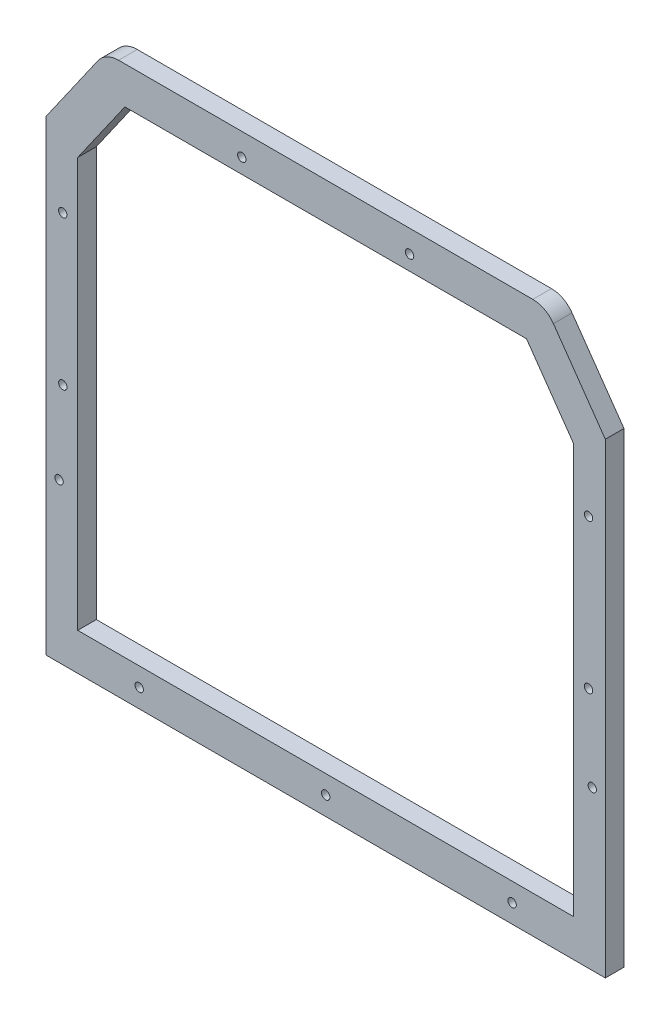
ISO-10303-21;
HEADER;
FILE_DESCRIPTION(('STEP AP214'),'2;1');
FILE_NAME('part.step','',(''),(''),'','','');
FILE_SCHEMA(('AUTOMOTIVE_DESIGN { 1 0 10303 214 1 1 1 1 }'));
ENDSEC;
DATA;
#1=APPLICATION_CONTEXT('core data for automotive mechanical design processes');
#2=APPLICATION_PROTOCOL_DEFINITION('international standard','automotive_design',2000,#1);
#3=PRODUCT_CONTEXT('',#1,'mechanical');
#4=PRODUCT('Part','Part','',(#3));
#5=PRODUCT_RELATED_PRODUCT_CATEGORY('part','',(#4));
#6=PRODUCT_DEFINITION_FORMATION('','',#4);
#7=PRODUCT_DEFINITION_CONTEXT('part definition',#1,'design');
#8=PRODUCT_DEFINITION('design','',#6,#7);
#9=PRODUCT_DEFINITION_SHAPE('','',#8);
#10=(LENGTH_UNIT() NAMED_UNIT(*) SI_UNIT(.MILLI.,.METRE.));
#11=(NAMED_UNIT(*) PLANE_ANGLE_UNIT() SI_UNIT($,.RADIAN.));
#12=(NAMED_UNIT(*) SI_UNIT($,.STERADIAN.) SOLID_ANGLE_UNIT());
#13=UNCERTAINTY_MEASURE_WITH_UNIT(LENGTH_MEASURE(1.E-05),#10,'distance_accuracy_value','');
#14=(GEOMETRIC_REPRESENTATION_CONTEXT(3) GLOBAL_UNCERTAINTY_ASSIGNED_CONTEXT((#13)) GLOBAL_UNIT_ASSIGNED_CONTEXT((#10,
#11,#12)) REPRESENTATION_CONTEXT('',''));
#15=CARTESIAN_POINT('',(0.,0.,0.));
#16=DIRECTION('',(0.,0.,1.));
#17=DIRECTION('',(1.,0.,0.));
#18=AXIS2_PLACEMENT_3D('',#15,#16,#17);
#19=CARTESIAN_POINT('',(292.5,121.743466350134,10.));
#20=DIRECTION('',(0.,0.,1.));
#21=DIRECTION('',(1.,0.,0.));
#22=AXIS2_PLACEMENT_3D('',#19,#20,#21);
#23=PLANE('',#22);
#24=CARTESIAN_POINT('',(10.,-35.,10.));
#25=DIRECTION('',(0.,0.,1.));
#26=DIRECTION('',(1.,0.,0.));
#27=AXIS2_PLACEMENT_3D('',#24,#25,#26);
#28=CIRCLE('',#27,2.25);
#29=CARTESIAN_POINT('',(12.25,-35.,10.));
#30=VERTEX_POINT('',#29);
#31=EDGE_CURVE('E254',#30,#30,#28,.T.);
#32=ORIENTED_EDGE('',*,*,#31,.F.);
#33=EDGE_LOOP('',(#32));
#34=FACE_BOUND('',#33,.T.);
#35=CARTESIAN_POINT('',(253.,-110.,10.));
#36=DIRECTION('',(0.,0.,1.));
#37=DIRECTION('',(1.,0.,0.));
#38=AXIS2_PLACEMENT_3D('',#35,#36,#37);
#39=CIRCLE('',#38,2.25000000000001);
#40=CARTESIAN_POINT('',(255.25,-110.,10.));
#41=VERTEX_POINT('',#40);
#42=EDGE_CURVE('E157',#41,#41,#39,.T.);
#43=ORIENTED_EDGE('',*,*,#42,.F.);
#44=EDGE_LOOP('',(#43));
#45=FACE_BOUND('',#44,.T.);
#46=CARTESIAN_POINT('',(153.,-110.,10.));
#47=DIRECTION('',(0.,0.,1.));
#48=DIRECTION('',(1.,0.,0.));
#49=AXIS2_PLACEMENT_3D('',#46,#47,#48);
#50=CIRCLE('',#49,2.25000000000001);
#51=CARTESIAN_POINT('',(155.25,-110.,10.));
#52=VERTEX_POINT('',#51);
#53=EDGE_CURVE('E264',#52,#52,#50,.T.);
#54=ORIENTED_EDGE('',*,*,#53,.F.);
#55=EDGE_LOOP('',(#54));
#56=FACE_BOUND('',#55,.T.);
#57=CARTESIAN_POINT('',(53.,-110.,10.));
#58=DIRECTION('',(0.,0.,1.));
#59=DIRECTION('',(1.,0.,0.));
#60=AXIS2_PLACEMENT_3D('',#57,#58,#59);
#61=CIRCLE('',#60,2.25);
#62=CARTESIAN_POINT('',(55.25,-110.,10.));
#63=VERTEX_POINT('',#62);
#64=EDGE_CURVE('E263',#63,#63,#61,.T.);
#65=ORIENTED_EDGE('',*,*,#64,.F.);
#66=EDGE_LOOP('',(#65));
#67=FACE_BOUND('',#66,.T.);
#68=CARTESIAN_POINT('',(296.,-35.,10.));
#69=DIRECTION('',(0.,0.,1.));
#70=DIRECTION('',(1.,0.,0.));
#71=AXIS2_PLACEMENT_3D('',#68,#69,#70);
#72=CIRCLE('',#71,2.24999999999995);
#73=CARTESIAN_POINT('',(298.25,-35.,10.));
#74=VERTEX_POINT('',#73);
#75=EDGE_CURVE('E278',#74,#74,#72,.T.);
#76=ORIENTED_EDGE('',*,*,#75,.F.);
#77=EDGE_LOOP('',(#76));
#78=FACE_BOUND('',#77,.T.);
#79=CARTESIAN_POINT('',(198.,163.806661735131,10.));
#80=DIRECTION('',(0.,0.,1.));
#81=DIRECTION('',(1.,0.,0.));
#82=AXIS2_PLACEMENT_3D('',#79,#80,#81);
#83=CIRCLE('',#82,2.25000000000001);
#84=CARTESIAN_POINT('',(200.25,163.806661735131,10.));
#85=VERTEX_POINT('',#84);
#86=EDGE_CURVE('E302',#85,#85,#83,.T.);
#87=ORIENTED_EDGE('',*,*,#86,.F.);
#88=EDGE_LOOP('',(#87));
#89=FACE_BOUND('',#88,.T.);
#90=CARTESIAN_POINT('',(12.,10.,10.));
#91=DIRECTION('',(0.,0.,1.));
#92=DIRECTION('',(1.,0.,0.));
#93=AXIS2_PLACEMENT_3D('',#90,#91,#92);
#94=CIRCLE('',#93,2.25);
#95=CARTESIAN_POINT('',(14.25,10.,10.));
#96=VERTEX_POINT('',#95);
#97=EDGE_CURVE('E310',#96,#96,#94,.T.);
#98=ORIENTED_EDGE('',*,*,#97,.F.);
#99=EDGE_LOOP('',(#98));
#100=FACE_BOUND('',#99,.T.);
#101=CARTESIAN_POINT('',(294.,10.,10.));
#102=DIRECTION('',(0.,0.,1.));
#103=DIRECTION('',(1.,0.,0.));
#104=AXIS2_PLACEMENT_3D('',#101,#102,#103);
#105=CIRCLE('',#104,2.24999999999995);
#106=CARTESIAN_POINT('',(296.25,10.,10.));
#107=VERTEX_POINT('',#106);
#108=EDGE_CURVE('E318',#107,#107,#105,.T.);
#109=ORIENTED_EDGE('',*,*,#108,.F.);
#110=EDGE_LOOP('',(#109));
#111=FACE_BOUND('',#110,.T.);
#112=CARTESIAN_POINT('',(294.,90.,10.));
#113=DIRECTION('',(0.,0.,1.));
#114=DIRECTION('',(-1.,0.,0.));
#115=AXIS2_PLACEMENT_3D('',#112,#113,#114);
#116=CIRCLE('',#115,2.24999999999995);
#117=CARTESIAN_POINT('',(291.75,90.,10.));
#118=VERTEX_POINT('',#117);
#119=EDGE_CURVE('E293',#118,#118,#116,.T.);
#120=ORIENTED_EDGE('',*,*,#119,.F.);
#121=EDGE_LOOP('',(#120));
#122=FACE_BOUND('',#121,.T.);
#123=CARTESIAN_POINT('',(12.,90.,10.));
#124=DIRECTION('',(0.,0.,1.));
#125=DIRECTION('',(-1.,0.,0.));
#126=AXIS2_PLACEMENT_3D('',#123,#124,#125);
#127=CIRCLE('',#126,2.25);
#128=CARTESIAN_POINT('',(9.75000000000001,90.,10.));
#129=VERTEX_POINT('',#128);
#130=EDGE_CURVE('E253',#129,#129,#127,.T.);
#131=ORIENTED_EDGE('',*,*,#130,.F.);
#132=EDGE_LOOP('',(#131));
#133=FACE_BOUND('',#132,.T.);
#134=CARTESIAN_POINT('',(108.,163.806661735131,10.));
#135=DIRECTION('',(0.,0.,1.));
#136=DIRECTION('',(1.,0.,0.));
#137=AXIS2_PLACEMENT_3D('',#134,#135,#136);
#138=CIRCLE('',#137,2.25);
#139=CARTESIAN_POINT('',(110.25,163.806661735131,10.));
#140=VERTEX_POINT('',#139);
#141=EDGE_CURVE('E301',#140,#140,#138,.T.);
#142=ORIENTED_EDGE('',*,*,#141,.F.);
#143=EDGE_LOOP('',(#142));
#144=FACE_BOUND('',#143,.T.);
#145=DIRECTION('',(0.,1.,0.));
#146=VECTOR('',#145,1.);
#147=CARTESIAN_POINT('',(286.,-100.,10.));
#148=LINE('',#147,#146);
#149=CARTESIAN_POINT('',(286.,-100.,10.));
#150=VERTEX_POINT('',#149);
#151=CARTESIAN_POINT('',(286.,119.69402422242,10.));
#152=VERTEX_POINT('',#151);
#153=EDGE_CURVE('E344',#150,#152,#148,.T.);
#154=ORIENTED_EDGE('',*,*,#153,.F.);
#155=DIRECTION('',(1.,0.,0.));
#156=VECTOR('',#155,1.);
#157=CARTESIAN_POINT('',(20.,-100.,10.));
#158=LINE('',#157,#156);
#159=CARTESIAN_POINT('',(20.,-100.,10.));
#160=VERTEX_POINT('',#159);
#161=EDGE_CURVE('E340',#160,#150,#158,.T.);
#162=ORIENTED_EDGE('',*,*,#161,.F.);
#163=DIRECTION('',(0.,-1.,0.));
#164=VECTOR('',#163,1.);
#165=CARTESIAN_POINT('',(20.,0.,10.));
#166=LINE('',#165,#164);
#167=CARTESIAN_POINT('',(20.,119.69402422242,10.));
#168=VERTEX_POINT('',#167);
#169=EDGE_CURVE('E337',#168,#160,#166,.T.);
#170=ORIENTED_EDGE('',*,*,#169,.F.);
#171=DIRECTION('',(-0.573576436351046,-0.819152044288992,0.));
#172=VECTOR('',#171,1.);
#173=CARTESIAN_POINT('',(20.,119.69402422242,10.));
#174=LINE('',#173,#172);
#175=CARTESIAN_POINT('',(45.2863410110351,155.806661735131,10.));
#176=VERTEX_POINT('',#175);
#177=EDGE_CURVE('E353',#176,#168,#174,.T.);
#178=ORIENTED_EDGE('',*,*,#177,.F.);
#179=DIRECTION('',(-1.,0.,0.));
#180=VECTOR('',#179,1.);
#181=CARTESIAN_POINT('',(45.2863410110351,155.806661735131,10.));
#182=LINE('',#181,#180);
#183=CARTESIAN_POINT('',(260.713658988965,155.806661735131,10.));
#184=VERTEX_POINT('',#183);
#185=EDGE_CURVE('E350',#184,#176,#182,.T.);
#186=ORIENTED_EDGE('',*,*,#185,.F.);
#187=DIRECTION('',(-0.573576436351044,0.819152044288994,0.));
#188=VECTOR('',#187,1.);
#189=CARTESIAN_POINT('',(260.713658988965,155.806661735131,10.));
#190=LINE('',#189,#188);
#191=EDGE_CURVE('E347',#152,#184,#190,.T.);
#192=ORIENTED_EDGE('',*,*,#191,.F.);
#193=EDGE_LOOP('',(#154,#162,#170,#178,#186,#192));
#194=FACE_BOUND('',#193,.T.);
#195=DIRECTION('',(-0.573576436351046,-0.819152044288992,0.));
#196=VECTOR('',#195,1.);
#197=CARTESIAN_POINT('',(30.8441025845472,170.049943625871,10.));
#198=LINE('',#197,#196);
#199=CARTESIAN_POINT('',(30.8441025845472,170.049943625871,10.));
#200=VERTEX_POINT('',#199);
#201=CARTESIAN_POINT('',(3.00000000000001,130.284444020226,10.));
#202=VERTEX_POINT('',#201);
#203=EDGE_CURVE('E153',#200,#202,#198,.T.);
#204=ORIENTED_EDGE('',*,*,#203,.T.);
#205=DIRECTION('',(0.,-1.,0.));
#206=VECTOR('',#205,1.);
#207=CARTESIAN_POINT('',(3.,206.355320804604,10.));
#208=LINE('',#207,#206);
#209=CARTESIAN_POINT('',(3.00000000000004,-120.,10.));
#210=VERTEX_POINT('',#209);
#211=EDGE_CURVE('E138',#202,#210,#208,.T.);
#212=ORIENTED_EDGE('',*,*,#211,.T.);
#213=DIRECTION('',(1.,0.,0.));
#214=VECTOR('',#213,1.);
#215=CARTESIAN_POINT('',(0.,-120.,10.));
#216=LINE('',#215,#214);
#217=CARTESIAN_POINT('',(303.,-120.,10.));
#218=VERTEX_POINT('',#217);
#219=EDGE_CURVE('E164',#210,#218,#216,.T.);
#220=ORIENTED_EDGE('',*,*,#219,.T.);
#221=DIRECTION('',(0.,1.,0.));
#222=VECTOR('',#221,1.);
#223=CARTESIAN_POINT('',(303.,206.355320804604,10.));
#224=LINE('',#223,#222);
#225=CARTESIAN_POINT('',(303.,130.284444020227,10.));
#226=VERTEX_POINT('',#225);
#227=EDGE_CURVE('E55',#218,#226,#224,.T.);
#228=ORIENTED_EDGE('',*,*,#227,.T.);
#229=DIRECTION('',(-0.573576436351046,0.819152044288992,0.));
#230=VECTOR('',#229,1.);
#231=CARTESIAN_POINT('',(303.558552597902,129.486748240873,10.));
#232=LINE('',#231,#230);
#233=CARTESIAN_POINT('',(275.155897415453,170.04994362587,10.));
#234=VERTEX_POINT('',#233);
#235=EDGE_CURVE('E193',#226,#234,#232,.T.);
#236=ORIENTED_EDGE('',*,*,#235,.T.);
#237=CARTESIAN_POINT('',(264.097344817551,162.306661735131,10.));
#238=DIRECTION('',(0.,0.,1.));
#239=DIRECTION('',(1.,0.,0.));
#240=AXIS2_PLACEMENT_3D('',#237,#238,#239);
#241=CIRCLE('',#240,13.5000000000001);
#242=CARTESIAN_POINT('',(264.097344817551,175.806661735131,10.));
#243=VERTEX_POINT('',#242);
#244=EDGE_CURVE('E228',#234,#243,#241,.T.);
#245=ORIENTED_EDGE('',*,*,#244,.T.);
#246=DIRECTION('',(-1.,0.,0.));
#247=VECTOR('',#246,1.);
#248=CARTESIAN_POINT('',(264.097344817551,175.806661735131,10.));
#249=LINE('',#248,#247);
#250=CARTESIAN_POINT('',(41.9026551824486,175.806661735131,10.));
#251=VERTEX_POINT('',#250);
#252=EDGE_CURVE('E170',#243,#251,#249,.T.);
#253=ORIENTED_EDGE('',*,*,#252,.T.);
#254=CARTESIAN_POINT('',(41.9026551824486,162.306661735131,10.));
#255=DIRECTION('',(0.,0.,1.));
#256=DIRECTION('',(1.,0.,0.));
#257=AXIS2_PLACEMENT_3D('',#254,#255,#256);
#258=CIRCLE('',#257,13.5);
#259=EDGE_CURVE('E161',#251,#200,#258,.T.);
#260=ORIENTED_EDGE('',*,*,#259,.T.);
#261=EDGE_LOOP('',(#204,#212,#220,#228,#236,#245,#253,#260));
#262=FACE_BOUND('',#261,.T.);
#263=ADVANCED_FACE('F39',(#34,#45,#56,#67,#78,#89,#100,#111,#122,#133,#144,#194,#262),#23,.T.);
#264=CARTESIAN_POINT('',(292.5,121.743466350134,0.));
#265=DIRECTION('',(0.,0.,1.));
#266=DIRECTION('',(1.,0.,0.));
#267=AXIS2_PLACEMENT_3D('',#264,#265,#266);
#268=PLANE('',#267);
#269=CARTESIAN_POINT('',(10.,-35.,0.));
#270=DIRECTION('',(0.,0.,1.));
#271=DIRECTION('',(1.,0.,0.));
#272=AXIS2_PLACEMENT_3D('',#269,#270,#271);
#273=CIRCLE('',#272,2.25);
#274=CARTESIAN_POINT('',(12.25,-35.,0.));
#275=VERTEX_POINT('',#274);
#276=EDGE_CURVE('E249',#275,#275,#273,.T.);
#277=ORIENTED_EDGE('',*,*,#276,.T.);
#278=EDGE_LOOP('',(#277));
#279=FACE_BOUND('',#278,.T.);
#280=CARTESIAN_POINT('',(253.,-110.,0.));
#281=DIRECTION('',(0.,0.,1.));
#282=DIRECTION('',(1.,0.,0.));
#283=AXIS2_PLACEMENT_3D('',#280,#281,#282);
#284=CIRCLE('',#283,2.25000000000001);
#285=CARTESIAN_POINT('',(255.25,-110.,0.));
#286=VERTEX_POINT('',#285);
#287=EDGE_CURVE('E268',#286,#286,#284,.T.);
#288=ORIENTED_EDGE('',*,*,#287,.T.);
#289=EDGE_LOOP('',(#288));
#290=FACE_BOUND('',#289,.T.);
#291=CARTESIAN_POINT('',(153.,-110.,0.));
#292=DIRECTION('',(0.,0.,1.));
#293=DIRECTION('',(1.,0.,0.));
#294=AXIS2_PLACEMENT_3D('',#291,#292,#293);
#295=CIRCLE('',#294,2.25000000000001);
#296=CARTESIAN_POINT('',(155.25,-110.,0.));
#297=VERTEX_POINT('',#296);
#298=EDGE_CURVE('E259',#297,#297,#295,.T.);
#299=ORIENTED_EDGE('',*,*,#298,.T.);
#300=EDGE_LOOP('',(#299));
#301=FACE_BOUND('',#300,.T.);
#302=CARTESIAN_POINT('',(53.,-110.,0.));
#303=DIRECTION('',(0.,0.,1.));
#304=DIRECTION('',(1.,0.,0.));
#305=AXIS2_PLACEMENT_3D('',#302,#303,#304);
#306=CIRCLE('',#305,2.25);
#307=CARTESIAN_POINT('',(55.25,-110.,0.));
#308=VERTEX_POINT('',#307);
#309=EDGE_CURVE('E282',#308,#308,#306,.T.);
#310=ORIENTED_EDGE('',*,*,#309,.T.);
#311=EDGE_LOOP('',(#310));
#312=FACE_BOUND('',#311,.T.);
#313=CARTESIAN_POINT('',(296.,-35.,0.));
#314=DIRECTION('',(0.,0.,1.));
#315=DIRECTION('',(1.,0.,0.));
#316=AXIS2_PLACEMENT_3D('',#313,#314,#315);
#317=CIRCLE('',#316,2.24999999999995);
#318=CARTESIAN_POINT('',(298.25,-35.,0.));
#319=VERTEX_POINT('',#318);
#320=EDGE_CURVE('E258',#319,#319,#317,.T.);
#321=ORIENTED_EDGE('',*,*,#320,.T.);
#322=EDGE_LOOP('',(#321));
#323=FACE_BOUND('',#322,.T.);
#324=CARTESIAN_POINT('',(198.,163.806661735131,0.));
#325=DIRECTION('',(0.,0.,1.));
#326=DIRECTION('',(1.,0.,0.));
#327=AXIS2_PLACEMENT_3D('',#324,#325,#326);
#328=CIRCLE('',#327,2.25000000000001);
#329=CARTESIAN_POINT('',(200.25,163.806661735131,0.));
#330=VERTEX_POINT('',#329);
#331=EDGE_CURVE('E297',#330,#330,#328,.T.);
#332=ORIENTED_EDGE('',*,*,#331,.T.);
#333=EDGE_LOOP('',(#332));
#334=FACE_BOUND('',#333,.T.);
#335=CARTESIAN_POINT('',(12.,10.,0.));
#336=DIRECTION('',(0.,0.,1.));
#337=DIRECTION('',(1.,0.,0.));
#338=AXIS2_PLACEMENT_3D('',#335,#336,#337);
#339=CIRCLE('',#338,2.25);
#340=CARTESIAN_POINT('',(14.25,10.,0.));
#341=VERTEX_POINT('',#340);
#342=EDGE_CURVE('E306',#341,#341,#339,.T.);
#343=ORIENTED_EDGE('',*,*,#342,.T.);
#344=EDGE_LOOP('',(#343));
#345=FACE_BOUND('',#344,.T.);
#346=CARTESIAN_POINT('',(294.,10.,0.));
#347=DIRECTION('',(0.,0.,1.));
#348=DIRECTION('',(1.,0.,0.));
#349=AXIS2_PLACEMENT_3D('',#346,#347,#348);
#350=CIRCLE('',#349,2.24999999999995);
#351=CARTESIAN_POINT('',(296.25,10.,0.));
#352=VERTEX_POINT('',#351);
#353=EDGE_CURVE('E314',#352,#352,#350,.T.);
#354=ORIENTED_EDGE('',*,*,#353,.T.);
#355=EDGE_LOOP('',(#354));
#356=FACE_BOUND('',#355,.T.);
#357=CARTESIAN_POINT('',(294.,90.,0.));
#358=DIRECTION('',(0.,0.,1.));
#359=DIRECTION('',(-1.,0.,0.));
#360=AXIS2_PLACEMENT_3D('',#357,#358,#359);
#361=CIRCLE('',#360,2.24999999999995);
#362=CARTESIAN_POINT('',(291.75,90.,0.));
#363=VERTEX_POINT('',#362);
#364=EDGE_CURVE('E322',#363,#363,#361,.T.);
#365=ORIENTED_EDGE('',*,*,#364,.T.);
#366=EDGE_LOOP('',(#365));
#367=FACE_BOUND('',#366,.T.);
#368=CARTESIAN_POINT('',(12.,90.,0.));
#369=DIRECTION('',(0.,0.,1.));
#370=DIRECTION('',(-1.,0.,0.));
#371=AXIS2_PLACEMENT_3D('',#368,#369,#370);
#372=CIRCLE('',#371,2.25);
#373=CARTESIAN_POINT('',(9.75000000000001,90.,0.));
#374=VERTEX_POINT('',#373);
#375=EDGE_CURVE('E289',#374,#374,#372,.T.);
#376=ORIENTED_EDGE('',*,*,#375,.T.);
#377=EDGE_LOOP('',(#376));
#378=FACE_BOUND('',#377,.T.);
#379=CARTESIAN_POINT('',(108.,163.806661735131,0.));
#380=DIRECTION('',(0.,0.,1.));
#381=DIRECTION('',(1.,0.,0.));
#382=AXIS2_PLACEMENT_3D('',#379,#380,#381);
#383=CIRCLE('',#382,2.25);
#384=CARTESIAN_POINT('',(110.25,163.806661735131,0.));
#385=VERTEX_POINT('',#384);
#386=EDGE_CURVE('E329',#385,#385,#383,.T.);
#387=ORIENTED_EDGE('',*,*,#386,.T.);
#388=EDGE_LOOP('',(#387));
#389=FACE_BOUND('',#388,.T.);
#390=DIRECTION('',(1.,0.,0.));
#391=VECTOR('',#390,1.);
#392=CARTESIAN_POINT('',(20.,-100.,0.));
#393=LINE('',#392,#391);
#394=CARTESIAN_POINT('',(20.,-100.,0.));
#395=VERTEX_POINT('',#394);
#396=CARTESIAN_POINT('',(286.,-100.,0.));
#397=VERTEX_POINT('',#396);
#398=EDGE_CURVE('E333',#395,#397,#393,.T.);
#399=ORIENTED_EDGE('',*,*,#398,.T.);
#400=DIRECTION('',(0.,1.,0.));
#401=VECTOR('',#400,1.);
#402=CARTESIAN_POINT('',(286.,119.69402422242,0.));
#403=LINE('',#402,#401);
#404=CARTESIAN_POINT('',(286.,119.69402422242,0.));
#405=VERTEX_POINT('',#404);
#406=EDGE_CURVE('E361',#397,#405,#403,.T.);
#407=ORIENTED_EDGE('',*,*,#406,.T.);
#408=DIRECTION('',(-0.573576436351044,0.819152044288994,0.));
#409=VECTOR('',#408,1.);
#410=CARTESIAN_POINT('',(260.713658988965,155.806661735131,0.));
#411=LINE('',#410,#409);
#412=CARTESIAN_POINT('',(260.713658988965,155.806661735131,0.));
#413=VERTEX_POINT('',#412);
#414=EDGE_CURVE('E365',#405,#413,#411,.T.);
#415=ORIENTED_EDGE('',*,*,#414,.T.);
#416=DIRECTION('',(-1.,0.,0.));
#417=VECTOR('',#416,1.);
#418=CARTESIAN_POINT('',(45.2863410110351,155.806661735131,0.));
#419=LINE('',#418,#417);
#420=CARTESIAN_POINT('',(45.2863410110351,155.806661735131,0.));
#421=VERTEX_POINT('',#420);
#422=EDGE_CURVE('E369',#413,#421,#419,.T.);
#423=ORIENTED_EDGE('',*,*,#422,.T.);
#424=DIRECTION('',(-0.573576436351046,-0.819152044288992,0.));
#425=VECTOR('',#424,1.);
#426=CARTESIAN_POINT('',(20.,119.69402422242,0.));
#427=LINE('',#426,#425);
#428=CARTESIAN_POINT('',(20.,119.69402422242,0.));
#429=VERTEX_POINT('',#428);
#430=EDGE_CURVE('E373',#421,#429,#427,.T.);
#431=ORIENTED_EDGE('',*,*,#430,.T.);
#432=DIRECTION('',(0.,-1.,0.));
#433=VECTOR('',#432,1.);
#434=CARTESIAN_POINT('',(20.,0.,0.));
#435=LINE('',#434,#433);
#436=EDGE_CURVE('E341',#429,#395,#435,.T.);
#437=ORIENTED_EDGE('',*,*,#436,.T.);
#438=EDGE_LOOP('',(#399,#407,#415,#423,#431,#437));
#439=FACE_BOUND('',#438,.T.);
#440=DIRECTION('',(0.,-1.,0.));
#441=VECTOR('',#440,1.);
#442=CARTESIAN_POINT('',(3.,206.355320804604,0.));
#443=LINE('',#442,#441);
#444=CARTESIAN_POINT('',(3.00000000000001,130.284444020226,0.));
#445=VERTEX_POINT('',#444);
#446=CARTESIAN_POINT('',(3.00000000000004,-120.,0.));
#447=VERTEX_POINT('',#446);
#448=EDGE_CURVE('E62',#445,#447,#443,.T.);
#449=ORIENTED_EDGE('',*,*,#448,.F.);
#450=DIRECTION('',(-0.573576436351046,-0.819152044288992,0.));
#451=VECTOR('',#450,1.);
#452=CARTESIAN_POINT('',(30.8441025845472,170.049943625871,0.));
#453=LINE('',#452,#451);
#454=CARTESIAN_POINT('',(30.8441025845472,170.049943625871,0.));
#455=VERTEX_POINT('',#454);
#456=EDGE_CURVE('E155',#455,#445,#453,.T.);
#457=ORIENTED_EDGE('',*,*,#456,.F.);
#458=CARTESIAN_POINT('',(41.9026551824486,162.306661735131,0.));
#459=DIRECTION('',(0.,0.,1.));
#460=DIRECTION('',(1.,0.,0.));
#461=AXIS2_PLACEMENT_3D('',#458,#459,#460);
#462=CIRCLE('',#461,13.5);
#463=CARTESIAN_POINT('',(41.9026551824486,175.806661735131,0.));
#464=VERTEX_POINT('',#463);
#465=EDGE_CURVE('E184',#464,#455,#462,.T.);
#466=ORIENTED_EDGE('',*,*,#465,.F.);
#467=DIRECTION('',(-1.,0.,0.));
#468=VECTOR('',#467,1.);
#469=CARTESIAN_POINT('',(264.097344817551,175.806661735131,0.));
#470=LINE('',#469,#468);
#471=CARTESIAN_POINT('',(264.097344817551,175.806661735131,0.));
#472=VERTEX_POINT('',#471);
#473=EDGE_CURVE('E181',#472,#464,#470,.T.);
#474=ORIENTED_EDGE('',*,*,#473,.F.);
#475=CARTESIAN_POINT('',(264.097344817551,162.306661735131,0.));
#476=DIRECTION('',(0.,0.,1.));
#477=DIRECTION('',(1.,0.,0.));
#478=AXIS2_PLACEMENT_3D('',#475,#476,#477);
#479=CIRCLE('',#478,13.5000000000001);
#480=CARTESIAN_POINT('',(275.155897415453,170.04994362587,0.));
#481=VERTEX_POINT('',#480);
#482=EDGE_CURVE('E177',#481,#472,#479,.T.);
#483=ORIENTED_EDGE('',*,*,#482,.F.);
#484=DIRECTION('',(-0.573576436351046,0.819152044288992,0.));
#485=VECTOR('',#484,1.);
#486=CARTESIAN_POINT('',(303.558552597902,129.486748240873,0.));
#487=LINE('',#486,#485);
#488=CARTESIAN_POINT('',(303.,130.284444020227,0.));
#489=VERTEX_POINT('',#488);
#490=EDGE_CURVE('E174',#489,#481,#487,.T.);
#491=ORIENTED_EDGE('',*,*,#490,.F.);
#492=DIRECTION('',(0.,1.,0.));
#493=VECTOR('',#492,1.);
#494=CARTESIAN_POINT('',(303.,206.355320804604,0.));
#495=LINE('',#494,#493);
#496=CARTESIAN_POINT('',(303.,-120.,0.));
#497=VERTEX_POINT('',#496);
#498=EDGE_CURVE('E210',#497,#489,#495,.T.);
#499=ORIENTED_EDGE('',*,*,#498,.F.);
#500=DIRECTION('',(1.,0.,0.));
#501=VECTOR('',#500,1.);
#502=CARTESIAN_POINT('',(0.,-120.,0.));
#503=LINE('',#502,#501);
#504=EDGE_CURVE('E189',#447,#497,#503,.T.);
#505=ORIENTED_EDGE('',*,*,#504,.F.);
#506=EDGE_LOOP('',(#449,#457,#466,#474,#483,#491,#499,#505));
#507=FACE_BOUND('',#506,.T.);
#508=ADVANCED_FACE('F216',(#279,#290,#301,#312,#323,#334,#345,#356,#367,#378,#389,#439,#507),
#268,.F.);
#509=CARTESIAN_POINT('',(303.558552597902,129.486748240873,10.));
#510=DIRECTION('',(-0.819152044288992,-0.573576436351046,0.));
#511=DIRECTION('',(0.573576436351046,-0.819152044288992,0.));
#512=AXIS2_PLACEMENT_3D('',#509,#510,#511);
#513=PLANE('',#512);
#514=DIRECTION('',(0.,0.,1.));
#515=VECTOR('',#514,1.);
#516=CARTESIAN_POINT('',(303.,130.284444020227,10.));
#517=LINE('',#516,#515);
#518=EDGE_CURVE('E158',#489,#226,#517,.T.);
#519=ORIENTED_EDGE('',*,*,#518,.F.);
#520=ORIENTED_EDGE('',*,*,#490,.T.);
#521=DIRECTION('',(0.,0.,-1.));
#522=VECTOR('',#521,1.);
#523=CARTESIAN_POINT('',(275.155897415453,170.04994362587,10.));
#524=LINE('',#523,#522);
#525=EDGE_CURVE('E204',#234,#481,#524,.T.);
#526=ORIENTED_EDGE('',*,*,#525,.F.);
#527=ORIENTED_EDGE('',*,*,#235,.F.);
#528=EDGE_LOOP('',(#519,#520,#526,#527));
#529=FACE_BOUND('',#528,.T.);
#530=ADVANCED_FACE('F41',(#529),#513,.F.);
#531=CARTESIAN_POINT('',(30.8441025845472,170.049943625871,10.));
#532=DIRECTION('',(0.819152044288992,-0.573576436351046,0.));
#533=DIRECTION('',(0.573576436351046,0.819152044288992,0.));
#534=AXIS2_PLACEMENT_3D('',#531,#532,#533);
#535=PLANE('',#534);
#536=DIRECTION('',(0.,0.,-1.));
#537=VECTOR('',#536,1.);
#538=CARTESIAN_POINT('',(3.00000000000001,130.284444020226,10.));
#539=LINE('',#538,#537);
#540=EDGE_CURVE('E141',#202,#445,#539,.T.);
#541=ORIENTED_EDGE('',*,*,#540,.F.);
#542=ORIENTED_EDGE('',*,*,#203,.F.);
#543=DIRECTION('',(0.,0.,-1.));
#544=VECTOR('',#543,1.);
#545=CARTESIAN_POINT('',(30.8441025845472,170.049943625871,10.));
#546=LINE('',#545,#544);
#547=EDGE_CURVE('E168',#200,#455,#546,.T.);
#548=ORIENTED_EDGE('',*,*,#547,.T.);
#549=ORIENTED_EDGE('',*,*,#456,.T.);
#550=EDGE_LOOP('',(#541,#542,#548,#549));
#551=FACE_BOUND('',#550,.T.);
#552=ADVANCED_FACE('F151',(#551),#535,.F.);
#553=CARTESIAN_POINT('',(0.,-120.,10.));
#554=DIRECTION('',(0.,1.,0.));
#555=DIRECTION('',(0.,0.,1.));
#556=AXIS2_PLACEMENT_3D('',#553,#554,#555);
#557=PLANE('',#556);
#558=DIRECTION('',(0.,0.,1.));
#559=VECTOR('',#558,1.);
#560=CARTESIAN_POINT('',(3.00000000000004,-120.,10.));
#561=LINE('',#560,#559);
#562=EDGE_CURVE('E12',#447,#210,#561,.T.);
#563=ORIENTED_EDGE('',*,*,#562,.F.);
#564=ORIENTED_EDGE('',*,*,#504,.T.);
#565=DIRECTION('',(0.,0.,-1.));
#566=VECTOR('',#565,1.);
#567=CARTESIAN_POINT('',(303.,-120.,10.));
#568=LINE('',#567,#566);
#569=EDGE_CURVE('E48',#218,#497,#568,.T.);
#570=ORIENTED_EDGE('',*,*,#569,.F.);
#571=ORIENTED_EDGE('',*,*,#219,.F.);
#572=EDGE_LOOP('',(#563,#564,#570,#571));
#573=FACE_BOUND('',#572,.T.);
#574=ADVANCED_FACE('F220',(#573),#557,.F.);
#575=CARTESIAN_POINT('',(264.097344817551,162.306661735131,10.));
#576=DIRECTION('',(0.,0.,-1.));
#577=DIRECTION('',(-1.,0.,0.));
#578=AXIS2_PLACEMENT_3D('',#575,#576,#577);
#579=CYLINDRICAL_SURFACE('',#578,13.5000000000001);
#580=ORIENTED_EDGE('',*,*,#482,.T.);
#581=DIRECTION('',(0.,0.,-1.));
#582=VECTOR('',#581,1.);
#583=CARTESIAN_POINT('',(264.097344817551,175.806661735131,10.));
#584=LINE('',#583,#582);
#585=EDGE_CURVE('E200',#243,#472,#584,.T.);
#586=ORIENTED_EDGE('',*,*,#585,.F.);
#587=ORIENTED_EDGE('',*,*,#244,.F.);
#588=ORIENTED_EDGE('',*,*,#525,.T.);
#589=EDGE_LOOP('',(#580,#586,#587,#588));
#590=FACE_BOUND('',#589,.T.);
#591=ADVANCED_FACE('F448',(#590),#579,.T.);
#592=CARTESIAN_POINT('',(264.097344817551,175.806661735131,10.));
#593=DIRECTION('',(0.,-1.,0.));
#594=DIRECTION('',(0.,0.,-1.));
#595=AXIS2_PLACEMENT_3D('',#592,#593,#594);
#596=PLANE('',#595);
#597=ORIENTED_EDGE('',*,*,#473,.T.);
#598=DIRECTION('',(0.,0.,-1.));
#599=VECTOR('',#598,1.);
#600=CARTESIAN_POINT('',(41.9026551824486,175.806661735131,10.));
#601=LINE('',#600,#599);
#602=EDGE_CURVE('E196',#251,#464,#601,.T.);
#603=ORIENTED_EDGE('',*,*,#602,.F.);
#604=ORIENTED_EDGE('',*,*,#252,.F.);
#605=ORIENTED_EDGE('',*,*,#585,.T.);
#606=EDGE_LOOP('',(#597,#603,#604,#605));
#607=FACE_BOUND('',#606,.T.);
#608=ADVANCED_FACE('F239',(#607),#596,.F.);
#609=CARTESIAN_POINT('',(41.9026551824486,162.306661735131,10.));
#610=DIRECTION('',(0.,0.,-1.));
#611=DIRECTION('',(-1.,0.,0.));
#612=AXIS2_PLACEMENT_3D('',#609,#610,#611);
#613=CYLINDRICAL_SURFACE('',#612,13.5);
#614=ORIENTED_EDGE('',*,*,#465,.T.);
#615=ORIENTED_EDGE('',*,*,#547,.F.);
#616=ORIENTED_EDGE('',*,*,#259,.F.);
#617=ORIENTED_EDGE('',*,*,#602,.T.);
#618=EDGE_LOOP('',(#614,#615,#616,#617));
#619=FACE_BOUND('',#618,.T.);
#620=ADVANCED_FACE('F243',(#619),#613,.T.);
#621=CARTESIAN_POINT('',(20.,-100.,10.));
#622=DIRECTION('',(0.,1.,0.));
#623=DIRECTION('',(0.,0.,1.));
#624=AXIS2_PLACEMENT_3D('',#621,#622,#623);
#625=PLANE('',#624);
#626=ORIENTED_EDGE('',*,*,#398,.F.);
#627=DIRECTION('',(0.,0.,-1.));
#628=VECTOR('',#627,1.);
#629=CARTESIAN_POINT('',(20.,-100.,10.));
#630=LINE('',#629,#628);
#631=EDGE_CURVE('E178',#160,#395,#630,.T.);
#632=ORIENTED_EDGE('',*,*,#631,.F.);
#633=ORIENTED_EDGE('',*,*,#161,.T.);
#634=DIRECTION('',(0.,0.,-1.));
#635=VECTOR('',#634,1.);
#636=CARTESIAN_POINT('',(286.,-100.,10.));
#637=LINE('',#636,#635);
#638=EDGE_CURVE('E390',#150,#397,#637,.T.);
#639=ORIENTED_EDGE('',*,*,#638,.T.);
#640=EDGE_LOOP('',(#626,#632,#633,#639));
#641=FACE_BOUND('',#640,.T.);
#642=ADVANCED_FACE('F403',(#641),#625,.T.);
#643=CARTESIAN_POINT('',(286.,119.69402422242,10.));
#644=DIRECTION('',(-1.,0.,0.));
#645=DIRECTION('',(0.,0.,1.));
#646=AXIS2_PLACEMENT_3D('',#643,#644,#645);
#647=PLANE('',#646);
#648=ORIENTED_EDGE('',*,*,#406,.F.);
#649=ORIENTED_EDGE('',*,*,#638,.F.);
#650=ORIENTED_EDGE('',*,*,#153,.T.);
#651=DIRECTION('',(0.,0.,-1.));
#652=VECTOR('',#651,1.);
#653=CARTESIAN_POINT('',(286.,119.69402422242,10.));
#654=LINE('',#653,#652);
#655=EDGE_CURVE('E388',#152,#405,#654,.T.);
#656=ORIENTED_EDGE('',*,*,#655,.T.);
#657=EDGE_LOOP('',(#648,#649,#650,#656));
#658=FACE_BOUND('',#657,.T.);
#659=ADVANCED_FACE('F416',(#658),#647,.T.);
#660=CARTESIAN_POINT('',(260.713658988965,155.806661735131,10.));
#661=DIRECTION('',(-0.819152044288994,-0.573576436351044,0.));
#662=DIRECTION('',(0.573576436351044,-0.819152044288994,0.));
#663=AXIS2_PLACEMENT_3D('',#660,#661,#662);
#664=PLANE('',#663);
#665=ORIENTED_EDGE('',*,*,#414,.F.);
#666=ORIENTED_EDGE('',*,*,#655,.F.);
#667=ORIENTED_EDGE('',*,*,#191,.T.);
#668=DIRECTION('',(0.,0.,-1.));
#669=VECTOR('',#668,1.);
#670=CARTESIAN_POINT('',(260.713658988965,155.806661735131,10.));
#671=LINE('',#670,#669);
#672=EDGE_CURVE('E385',#184,#413,#671,.T.);
#673=ORIENTED_EDGE('',*,*,#672,.T.);
#674=EDGE_LOOP('',(#665,#666,#667,#673));
#675=FACE_BOUND('',#674,.T.);
#676=ADVANCED_FACE('F420',(#675),#664,.T.);
#677=CARTESIAN_POINT('',(45.2863410110351,155.806661735131,10.));
#678=DIRECTION('',(0.,-1.,0.));
#679=DIRECTION('',(0.,0.,-1.));
#680=AXIS2_PLACEMENT_3D('',#677,#678,#679);
#681=PLANE('',#680);
#682=ORIENTED_EDGE('',*,*,#422,.F.);
#683=ORIENTED_EDGE('',*,*,#672,.F.);
#684=ORIENTED_EDGE('',*,*,#185,.T.);
#685=DIRECTION('',(0.,0.,-1.));
#686=VECTOR('',#685,1.);
#687=CARTESIAN_POINT('',(45.2863410110351,155.806661735131,10.));
#688=LINE('',#687,#686);
#689=EDGE_CURVE('E382',#176,#421,#688,.T.);
#690=ORIENTED_EDGE('',*,*,#689,.T.);
#691=EDGE_LOOP('',(#682,#683,#684,#690));
#692=FACE_BOUND('',#691,.T.);
#693=ADVANCED_FACE('F423',(#692),#681,.T.);
#694=CARTESIAN_POINT('',(20.,119.69402422242,10.));
#695=DIRECTION('',(0.819152044288992,-0.573576436351046,0.));
#696=DIRECTION('',(0.573576436351046,0.819152044288992,0.));
#697=AXIS2_PLACEMENT_3D('',#694,#695,#696);
#698=PLANE('',#697);
#699=ORIENTED_EDGE('',*,*,#430,.F.);
#700=ORIENTED_EDGE('',*,*,#689,.F.);
#701=ORIENTED_EDGE('',*,*,#177,.T.);
#702=DIRECTION('',(0.,0.,-1.));
#703=VECTOR('',#702,1.);
#704=CARTESIAN_POINT('',(20.,119.69402422242,10.));
#705=LINE('',#704,#703);
#706=EDGE_CURVE('E357',#168,#429,#705,.T.);
#707=ORIENTED_EDGE('',*,*,#706,.T.);
#708=EDGE_LOOP('',(#699,#700,#701,#707));
#709=FACE_BOUND('',#708,.T.);
#710=ADVANCED_FACE('F409',(#709),#698,.T.);
#711=CARTESIAN_POINT('',(20.,0.,10.));
#712=DIRECTION('',(1.,0.,0.));
#713=DIRECTION('',(0.,0.,-1.));
#714=AXIS2_PLACEMENT_3D('',#711,#712,#713);
#715=PLANE('',#714);
#716=ORIENTED_EDGE('',*,*,#436,.F.);
#717=ORIENTED_EDGE('',*,*,#706,.F.);
#718=ORIENTED_EDGE('',*,*,#169,.T.);
#719=ORIENTED_EDGE('',*,*,#631,.T.);
#720=EDGE_LOOP('',(#716,#717,#718,#719));
#721=FACE_BOUND('',#720,.T.);
#722=ADVANCED_FACE('F400',(#721),#715,.T.);
#723=CARTESIAN_POINT('',(108.,163.806661735131,0.));
#724=DIRECTION('',(0.,0.,1.));
#725=DIRECTION('',(1.,0.,0.));
#726=AXIS2_PLACEMENT_3D('',#723,#724,#725);
#727=CYLINDRICAL_SURFACE('',#726,2.25);
#728=ORIENTED_EDGE('',*,*,#386,.F.);
#729=EDGE_LOOP('',(#728));
#730=FACE_BOUND('',#729,.T.);
#731=ORIENTED_EDGE('',*,*,#141,.T.);
#732=EDGE_LOOP('',(#731));
#733=FACE_BOUND('',#732,.T.);
#734=ADVANCED_FACE('F500',(#730,#733),#727,.F.);
#735=CARTESIAN_POINT('',(12.,90.,0.));
#736=DIRECTION('',(0.,0.,1.));
#737=DIRECTION('',(1.,0.,0.));
#738=AXIS2_PLACEMENT_3D('',#735,#736,#737);
#739=CYLINDRICAL_SURFACE('',#738,2.25);
#740=ORIENTED_EDGE('',*,*,#375,.F.);
#741=EDGE_LOOP('',(#740));
#742=FACE_BOUND('',#741,.T.);
#743=ORIENTED_EDGE('',*,*,#130,.T.);
#744=EDGE_LOOP('',(#743));
#745=FACE_BOUND('',#744,.T.);
#746=ADVANCED_FACE('F509',(#742,#745),#739,.F.);
#747=CARTESIAN_POINT('',(294.,90.,0.));
#748=DIRECTION('',(0.,0.,1.));
#749=DIRECTION('',(1.,0.,0.));
#750=AXIS2_PLACEMENT_3D('',#747,#748,#749);
#751=CYLINDRICAL_SURFACE('',#750,2.24999999999995);
#752=ORIENTED_EDGE('',*,*,#364,.F.);
#753=EDGE_LOOP('',(#752));
#754=FACE_BOUND('',#753,.T.);
#755=ORIENTED_EDGE('',*,*,#119,.T.);
#756=EDGE_LOOP('',(#755));
#757=FACE_BOUND('',#756,.T.);
#758=ADVANCED_FACE('F519',(#754,#757),#751,.F.);
#759=CARTESIAN_POINT('',(294.,10.,0.));
#760=DIRECTION('',(0.,0.,1.));
#761=DIRECTION('',(1.,0.,0.));
#762=AXIS2_PLACEMENT_3D('',#759,#760,#761);
#763=CYLINDRICAL_SURFACE('',#762,2.24999999999995);
#764=ORIENTED_EDGE('',*,*,#353,.F.);
#765=EDGE_LOOP('',(#764));
#766=FACE_BOUND('',#765,.T.);
#767=ORIENTED_EDGE('',*,*,#108,.T.);
#768=EDGE_LOOP('',(#767));
#769=FACE_BOUND('',#768,.T.);
#770=ADVANCED_FACE('F529',(#766,#769),#763,.F.);
#771=CARTESIAN_POINT('',(12.,10.,0.));
#772=DIRECTION('',(0.,0.,1.));
#773=DIRECTION('',(1.,0.,0.));
#774=AXIS2_PLACEMENT_3D('',#771,#772,#773);
#775=CYLINDRICAL_SURFACE('',#774,2.25);
#776=ORIENTED_EDGE('',*,*,#342,.F.);
#777=EDGE_LOOP('',(#776));
#778=FACE_BOUND('',#777,.T.);
#779=ORIENTED_EDGE('',*,*,#97,.T.);
#780=EDGE_LOOP('',(#779));
#781=FACE_BOUND('',#780,.T.);
#782=ADVANCED_FACE('F539',(#778,#781),#775,.F.);
#783=CARTESIAN_POINT('',(198.,163.806661735131,0.));
#784=DIRECTION('',(0.,0.,1.));
#785=DIRECTION('',(1.,0.,0.));
#786=AXIS2_PLACEMENT_3D('',#783,#784,#785);
#787=CYLINDRICAL_SURFACE('',#786,2.25000000000001);
#788=ORIENTED_EDGE('',*,*,#331,.F.);
#789=EDGE_LOOP('',(#788));
#790=FACE_BOUND('',#789,.T.);
#791=ORIENTED_EDGE('',*,*,#86,.T.);
#792=EDGE_LOOP('',(#791));
#793=FACE_BOUND('',#792,.T.);
#794=ADVANCED_FACE('F549',(#790,#793),#787,.F.);
#795=CARTESIAN_POINT('',(296.,-35.,0.));
#796=DIRECTION('',(0.,0.,1.));
#797=DIRECTION('',(1.,0.,0.));
#798=AXIS2_PLACEMENT_3D('',#795,#796,#797);
#799=CYLINDRICAL_SURFACE('',#798,2.24999999999995);
#800=ORIENTED_EDGE('',*,*,#320,.F.);
#801=EDGE_LOOP('',(#800));
#802=FACE_BOUND('',#801,.T.);
#803=ORIENTED_EDGE('',*,*,#75,.T.);
#804=EDGE_LOOP('',(#803));
#805=FACE_BOUND('',#804,.T.);
#806=ADVANCED_FACE('F559',(#802,#805),#799,.F.);
#807=CARTESIAN_POINT('',(53.,-110.,0.));
#808=DIRECTION('',(0.,0.,1.));
#809=DIRECTION('',(1.,0.,0.));
#810=AXIS2_PLACEMENT_3D('',#807,#808,#809);
#811=CYLINDRICAL_SURFACE('',#810,2.25);
#812=ORIENTED_EDGE('',*,*,#309,.F.);
#813=EDGE_LOOP('',(#812));
#814=FACE_BOUND('',#813,.T.);
#815=ORIENTED_EDGE('',*,*,#64,.T.);
#816=EDGE_LOOP('',(#815));
#817=FACE_BOUND('',#816,.T.);
#818=ADVANCED_FACE('F569',(#814,#817),#811,.F.);
#819=CARTESIAN_POINT('',(153.,-110.,0.));
#820=DIRECTION('',(0.,0.,1.));
#821=DIRECTION('',(1.,0.,0.));
#822=AXIS2_PLACEMENT_3D('',#819,#820,#821);
#823=CYLINDRICAL_SURFACE('',#822,2.25000000000001);
#824=ORIENTED_EDGE('',*,*,#298,.F.);
#825=EDGE_LOOP('',(#824));
#826=FACE_BOUND('',#825,.T.);
#827=ORIENTED_EDGE('',*,*,#53,.T.);
#828=EDGE_LOOP('',(#827));
#829=FACE_BOUND('',#828,.T.);
#830=ADVANCED_FACE('F579',(#826,#829),#823,.F.);
#831=CARTESIAN_POINT('',(253.,-110.,0.));
#832=DIRECTION('',(0.,0.,1.));
#833=DIRECTION('',(1.,0.,0.));
#834=AXIS2_PLACEMENT_3D('',#831,#832,#833);
#835=CYLINDRICAL_SURFACE('',#834,2.25000000000001);
#836=ORIENTED_EDGE('',*,*,#287,.F.);
#837=EDGE_LOOP('',(#836));
#838=FACE_BOUND('',#837,.T.);
#839=ORIENTED_EDGE('',*,*,#42,.T.);
#840=EDGE_LOOP('',(#839));
#841=FACE_BOUND('',#840,.T.);
#842=ADVANCED_FACE('F589',(#838,#841),#835,.F.);
#843=CARTESIAN_POINT('',(10.,-35.,0.));
#844=DIRECTION('',(0.,0.,1.));
#845=DIRECTION('',(1.,0.,0.));
#846=AXIS2_PLACEMENT_3D('',#843,#844,#845);
#847=CYLINDRICAL_SURFACE('',#846,2.25);
#848=ORIENTED_EDGE('',*,*,#276,.F.);
#849=EDGE_LOOP('',(#848));
#850=FACE_BOUND('',#849,.T.);
#851=ORIENTED_EDGE('',*,*,#31,.T.);
#852=EDGE_LOOP('',(#851));
#853=FACE_BOUND('',#852,.T.);
#854=ADVANCED_FACE('F598',(#850,#853),#847,.F.);
#855=CARTESIAN_POINT('',(303.,206.355320804604,0.));
#856=DIRECTION('',(1.,0.,0.));
#857=DIRECTION('',(0.,1.,0.));
#858=AXIS2_PLACEMENT_3D('',#855,#856,#857);
#859=PLANE('',#858);
#860=ORIENTED_EDGE('',*,*,#518,.T.);
#861=ORIENTED_EDGE('',*,*,#227,.F.);
#862=ORIENTED_EDGE('',*,*,#569,.T.);
#863=ORIENTED_EDGE('',*,*,#498,.T.);
#864=EDGE_LOOP('',(#860,#861,#862,#863));
#865=FACE_BOUND('',#864,.T.);
#866=ADVANCED_FACE('F209',(#865),#859,.T.);
#867=CARTESIAN_POINT('',(3.,206.355320804604,0.));
#868=DIRECTION('',(-1.,0.,0.));
#869=DIRECTION('',(0.,-1.,0.));
#870=AXIS2_PLACEMENT_3D('',#867,#868,#869);
#871=PLANE('',#870);
#872=ORIENTED_EDGE('',*,*,#540,.T.);
#873=ORIENTED_EDGE('',*,*,#448,.T.);
#874=ORIENTED_EDGE('',*,*,#562,.T.);
#875=ORIENTED_EDGE('',*,*,#211,.F.);
#876=EDGE_LOOP('',(#872,#873,#874,#875));
#877=FACE_BOUND('',#876,.T.);
#878=ADVANCED_FACE('F140',(#877),#871,.T.);
#879=CLOSED_SHELL('',(#263,#508,#530,#552,#574,#591,#608,#620,#642,#659,#676,#693,#710,#722,
#734,#746,#758,#770,#782,#794,#806,#818,#830,#842,#854,#866,#878));
#880=MANIFOLD_SOLID_BREP('B2',#879);
#881=ADVANCED_BREP_SHAPE_REPRESENTATION('',(#18,#880),#14);
#882=SHAPE_DEFINITION_REPRESENTATION(#9,#881);
ENDSEC;
END-ISO-10303-21;
